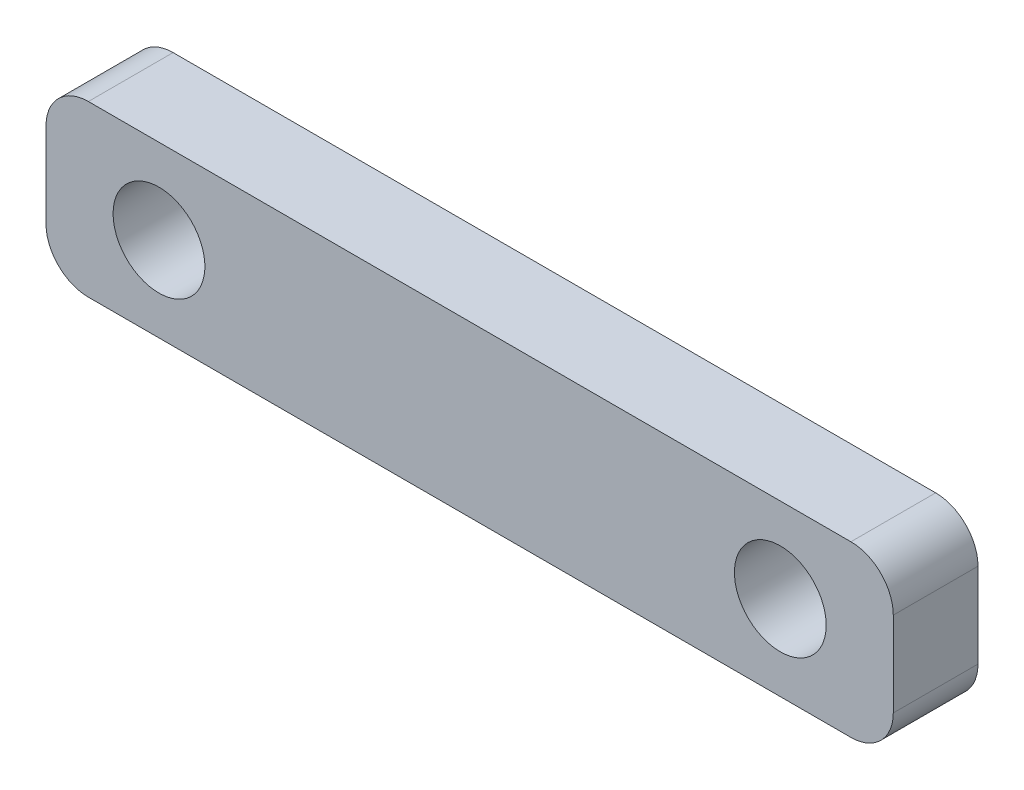
ISO-10303-21;
HEADER;
FILE_DESCRIPTION(('STEP AP214'),'2;1');
FILE_NAME('part.step','',(''),(''),'','','');
FILE_SCHEMA(('AUTOMOTIVE_DESIGN { 1 0 10303 214 1 1 1 1 }'));
ENDSEC;
DATA;
#1=APPLICATION_CONTEXT('core data for automotive mechanical design processes');
#2=APPLICATION_PROTOCOL_DEFINITION('international standard','automotive_design',2000,#1);
#3=PRODUCT_CONTEXT('',#1,'mechanical');
#4=PRODUCT('Part','Part','',(#3));
#5=PRODUCT_RELATED_PRODUCT_CATEGORY('part','',(#4));
#6=PRODUCT_DEFINITION_FORMATION('','',#4);
#7=PRODUCT_DEFINITION_CONTEXT('part definition',#1,'design');
#8=PRODUCT_DEFINITION('design','',#6,#7);
#9=PRODUCT_DEFINITION_SHAPE('','',#8);
#10=(LENGTH_UNIT() NAMED_UNIT(*) SI_UNIT(.MILLI.,.METRE.));
#11=(NAMED_UNIT(*) PLANE_ANGLE_UNIT() SI_UNIT($,.RADIAN.));
#12=(NAMED_UNIT(*) SI_UNIT($,.STERADIAN.) SOLID_ANGLE_UNIT());
#13=UNCERTAINTY_MEASURE_WITH_UNIT(LENGTH_MEASURE(1.E-05),#10,'distance_accuracy_value','');
#14=(GEOMETRIC_REPRESENTATION_CONTEXT(3) GLOBAL_UNCERTAINTY_ASSIGNED_CONTEXT((#13)) GLOBAL_UNIT_ASSIGNED_CONTEXT((#10,
#11,#12)) REPRESENTATION_CONTEXT('',''));
#15=CARTESIAN_POINT('',(0.,0.,0.));
#16=DIRECTION('',(0.,0.,1.));
#17=DIRECTION('',(1.,0.,0.));
#18=AXIS2_PLACEMENT_3D('',#15,#16,#17);
#19=CARTESIAN_POINT('',(-27.,2.99999999999999,6.));
#20=DIRECTION('',(0.,0.,1.));
#21=DIRECTION('',(1.,0.,0.));
#22=AXIS2_PLACEMENT_3D('',#19,#20,#21);
#23=PLANE('',#22);
#24=CARTESIAN_POINT('',(-22.,0.,6.));
#25=DIRECTION('',(0.,0.,-1.));
#26=DIRECTION('',(-1.,0.,0.));
#27=AXIS2_PLACEMENT_3D('',#24,#25,#26);
#28=CIRCLE('',#27,3.25);
#29=CARTESIAN_POINT('',(-25.25,0.,6.));
#30=VERTEX_POINT('',#29);
#31=EDGE_CURVE('E192',#30,#30,#28,.T.);
#32=ORIENTED_EDGE('',*,*,#31,.T.);
#33=EDGE_LOOP('',(#32));
#34=FACE_BOUND('',#33,.T.);
#35=CARTESIAN_POINT('',(-27.,2.99999999999999,6.));
#36=DIRECTION('',(0.,0.,1.));
#37=DIRECTION('',(1.,0.,0.));
#38=AXIS2_PLACEMENT_3D('',#35,#36,#37);
#39=CIRCLE('',#38,3.);
#40=CARTESIAN_POINT('',(-27.,5.99999999999999,6.));
#41=VERTEX_POINT('',#40);
#42=CARTESIAN_POINT('',(-30.,2.99999999999999,6.));
#43=VERTEX_POINT('',#42);
#44=EDGE_CURVE('E95',#41,#43,#39,.T.);
#45=ORIENTED_EDGE('',*,*,#44,.T.);
#46=DIRECTION('',(0.,1.,0.));
#47=VECTOR('',#46,1.);
#48=CARTESIAN_POINT('',(-30.,-2.99999999999999,6.));
#49=LINE('',#48,#47);
#50=CARTESIAN_POINT('',(-30.,-2.99999999999999,6.));
#51=VERTEX_POINT('',#50);
#52=EDGE_CURVE('E177',#51,#43,#49,.T.);
#53=ORIENTED_EDGE('',*,*,#52,.F.);
#54=CARTESIAN_POINT('',(-27.,-2.99999999999999,6.));
#55=DIRECTION('',(0.,0.,1.));
#56=DIRECTION('',(1.,0.,0.));
#57=AXIS2_PLACEMENT_3D('',#54,#55,#56);
#58=CIRCLE('',#57,3.);
#59=CARTESIAN_POINT('',(-27.,-5.99999999999999,6.));
#60=VERTEX_POINT('',#59);
#61=EDGE_CURVE('E166',#51,#60,#58,.T.);
#62=ORIENTED_EDGE('',*,*,#61,.T.);
#63=DIRECTION('',(1.,0.,0.));
#64=VECTOR('',#63,1.);
#65=CARTESIAN_POINT('',(-27.,-5.99999999999999,6.));
#66=LINE('',#65,#64);
#67=CARTESIAN_POINT('',(27.,-5.99999999999999,6.));
#68=VERTEX_POINT('',#67);
#69=EDGE_CURVE('E130',#60,#68,#66,.T.);
#70=ORIENTED_EDGE('',*,*,#69,.T.);
#71=CARTESIAN_POINT('',(27.,-2.99999999999999,6.));
#72=DIRECTION('',(0.,0.,1.));
#73=DIRECTION('',(1.,0.,0.));
#74=AXIS2_PLACEMENT_3D('',#71,#72,#73);
#75=CIRCLE('',#74,3.);
#76=CARTESIAN_POINT('',(30.,-2.99999999999999,6.));
#77=VERTEX_POINT('',#76);
#78=EDGE_CURVE('E127',#68,#77,#75,.T.);
#79=ORIENTED_EDGE('',*,*,#78,.T.);
#80=DIRECTION('',(0.,-1.,0.));
#81=VECTOR('',#80,1.);
#82=CARTESIAN_POINT('',(30.,2.99999999999999,6.));
#83=LINE('',#82,#81);
#84=CARTESIAN_POINT('',(30.,2.99999999999999,6.));
#85=VERTEX_POINT('',#84);
#86=EDGE_CURVE('E116',#85,#77,#83,.T.);
#87=ORIENTED_EDGE('',*,*,#86,.F.);
#88=CARTESIAN_POINT('',(27.,2.99999999999999,6.));
#89=DIRECTION('',(0.,0.,1.));
#90=DIRECTION('',(1.,0.,0.));
#91=AXIS2_PLACEMENT_3D('',#88,#89,#90);
#92=CIRCLE('',#91,3.);
#93=CARTESIAN_POINT('',(27.,5.99999999999999,6.));
#94=VERTEX_POINT('',#93);
#95=EDGE_CURVE('E122',#85,#94,#92,.T.);
#96=ORIENTED_EDGE('',*,*,#95,.T.);
#97=DIRECTION('',(-1.,0.,0.));
#98=VECTOR('',#97,1.);
#99=CARTESIAN_POINT('',(27.,5.99999999999999,6.));
#100=LINE('',#99,#98);
#101=EDGE_CURVE('E56',#94,#41,#100,.T.);
#102=ORIENTED_EDGE('',*,*,#101,.T.);
#103=EDGE_LOOP('',(#45,#53,#62,#70,#79,#87,#96,#102));
#104=FACE_BOUND('',#103,.T.);
#105=CARTESIAN_POINT('',(22.,0.,6.));
#106=DIRECTION('',(0.,0.,1.));
#107=DIRECTION('',(1.,0.,0.));
#108=AXIS2_PLACEMENT_3D('',#105,#106,#107);
#109=CIRCLE('',#108,3.25);
#110=CARTESIAN_POINT('',(25.25,0.,6.));
#111=VERTEX_POINT('',#110);
#112=EDGE_CURVE('E140',#111,#111,#109,.T.);
#113=ORIENTED_EDGE('',*,*,#112,.F.);
#114=EDGE_LOOP('',(#113));
#115=FACE_BOUND('',#114,.T.);
#116=ADVANCED_FACE('F39',(#34,#104,#115),#23,.T.);
#117=CARTESIAN_POINT('',(-27.,2.99999999999999,0.));
#118=DIRECTION('',(0.,0.,1.));
#119=DIRECTION('',(1.,0.,0.));
#120=AXIS2_PLACEMENT_3D('',#117,#118,#119);
#121=PLANE('',#120);
#122=CARTESIAN_POINT('',(-22.,0.,0.));
#123=DIRECTION('',(0.,0.,-1.));
#124=DIRECTION('',(-1.,0.,0.));
#125=AXIS2_PLACEMENT_3D('',#122,#123,#124);
#126=CIRCLE('',#125,3.25);
#127=CARTESIAN_POINT('',(-25.25,0.,0.));
#128=VERTEX_POINT('',#127);
#129=EDGE_CURVE('E195',#128,#128,#126,.T.);
#130=ORIENTED_EDGE('',*,*,#129,.F.);
#131=EDGE_LOOP('',(#130));
#132=FACE_BOUND('',#131,.T.);
#133=CARTESIAN_POINT('',(-27.,2.99999999999999,0.));
#134=DIRECTION('',(0.,0.,1.));
#135=DIRECTION('',(1.,0.,0.));
#136=AXIS2_PLACEMENT_3D('',#133,#134,#135);
#137=CIRCLE('',#136,3.);
#138=CARTESIAN_POINT('',(-27.,5.99999999999999,0.));
#139=VERTEX_POINT('',#138);
#140=CARTESIAN_POINT('',(-30.,2.99999999999999,0.));
#141=VERTEX_POINT('',#140);
#142=EDGE_CURVE('E136',#139,#141,#137,.T.);
#143=ORIENTED_EDGE('',*,*,#142,.F.);
#144=DIRECTION('',(-1.,0.,0.));
#145=VECTOR('',#144,1.);
#146=CARTESIAN_POINT('',(27.,5.99999999999999,0.));
#147=LINE('',#146,#145);
#148=CARTESIAN_POINT('',(27.,5.99999999999999,0.));
#149=VERTEX_POINT('',#148);
#150=EDGE_CURVE('E89',#149,#139,#147,.T.);
#151=ORIENTED_EDGE('',*,*,#150,.F.);
#152=CARTESIAN_POINT('',(27.,2.99999999999999,0.));
#153=DIRECTION('',(0.,0.,1.));
#154=DIRECTION('',(1.,0.,0.));
#155=AXIS2_PLACEMENT_3D('',#152,#153,#154);
#156=CIRCLE('',#155,3.);
#157=CARTESIAN_POINT('',(30.,2.99999999999999,0.));
#158=VERTEX_POINT('',#157);
#159=EDGE_CURVE('E83',#158,#149,#156,.T.);
#160=ORIENTED_EDGE('',*,*,#159,.F.);
#161=DIRECTION('',(0.,-1.,0.));
#162=VECTOR('',#161,1.);
#163=CARTESIAN_POINT('',(30.,2.99999999999999,0.));
#164=LINE('',#163,#162);
#165=CARTESIAN_POINT('',(30.,-2.99999999999999,0.));
#166=VERTEX_POINT('',#165);
#167=EDGE_CURVE('E118',#158,#166,#164,.T.);
#168=ORIENTED_EDGE('',*,*,#167,.T.);
#169=CARTESIAN_POINT('',(27.,-2.99999999999999,0.));
#170=DIRECTION('',(0.,0.,1.));
#171=DIRECTION('',(1.,0.,0.));
#172=AXIS2_PLACEMENT_3D('',#169,#170,#171);
#173=CIRCLE('',#172,3.);
#174=CARTESIAN_POINT('',(27.,-5.99999999999999,0.));
#175=VERTEX_POINT('',#174);
#176=EDGE_CURVE('E147',#175,#166,#173,.T.);
#177=ORIENTED_EDGE('',*,*,#176,.F.);
#178=DIRECTION('',(1.,0.,0.));
#179=VECTOR('',#178,1.);
#180=CARTESIAN_POINT('',(-27.,-5.99999999999999,0.));
#181=LINE('',#180,#179);
#182=CARTESIAN_POINT('',(-27.,-5.99999999999999,0.));
#183=VERTEX_POINT('',#182);
#184=EDGE_CURVE('E145',#183,#175,#181,.T.);
#185=ORIENTED_EDGE('',*,*,#184,.F.);
#186=CARTESIAN_POINT('',(-27.,-2.99999999999999,0.));
#187=DIRECTION('',(0.,0.,1.));
#188=DIRECTION('',(1.,0.,0.));
#189=AXIS2_PLACEMENT_3D('',#186,#187,#188);
#190=CIRCLE('',#189,3.);
#191=CARTESIAN_POINT('',(-30.,-2.99999999999999,0.));
#192=VERTEX_POINT('',#191);
#193=EDGE_CURVE('E143',#192,#183,#190,.T.);
#194=ORIENTED_EDGE('',*,*,#193,.F.);
#195=DIRECTION('',(0.,1.,0.));
#196=VECTOR('',#195,1.);
#197=CARTESIAN_POINT('',(-30.,-2.99999999999999,0.));
#198=LINE('',#197,#196);
#199=EDGE_CURVE('E139',#192,#141,#198,.T.);
#200=ORIENTED_EDGE('',*,*,#199,.T.);
#201=EDGE_LOOP('',(#143,#151,#160,#168,#177,#185,#194,#200));
#202=FACE_BOUND('',#201,.T.);
#203=CARTESIAN_POINT('',(22.,0.,0.));
#204=DIRECTION('',(0.,0.,1.));
#205=DIRECTION('',(1.,0.,0.));
#206=AXIS2_PLACEMENT_3D('',#203,#204,#205);
#207=CIRCLE('',#206,3.25);
#208=CARTESIAN_POINT('',(25.25,0.,0.));
#209=VERTEX_POINT('',#208);
#210=EDGE_CURVE('E189',#209,#209,#207,.T.);
#211=ORIENTED_EDGE('',*,*,#210,.T.);
#212=EDGE_LOOP('',(#211));
#213=FACE_BOUND('',#212,.T.);
#214=ADVANCED_FACE('F173',(#132,#202,#213),#121,.F.);
#215=CARTESIAN_POINT('',(-27.,2.99999999999999,6.));
#216=DIRECTION('',(0.,0.,-1.));
#217=DIRECTION('',(-1.,0.,0.));
#218=AXIS2_PLACEMENT_3D('',#215,#216,#217);
#219=CYLINDRICAL_SURFACE('',#218,3.);
#220=ORIENTED_EDGE('',*,*,#142,.T.);
#221=DIRECTION('',(0.,0.,-1.));
#222=VECTOR('',#221,1.);
#223=CARTESIAN_POINT('',(-30.,2.99999999999999,6.));
#224=LINE('',#223,#222);
#225=EDGE_CURVE('E11',#43,#141,#224,.T.);
#226=ORIENTED_EDGE('',*,*,#225,.F.);
#227=ORIENTED_EDGE('',*,*,#44,.F.);
#228=DIRECTION('',(0.,0.,-1.));
#229=VECTOR('',#228,1.);
#230=CARTESIAN_POINT('',(-27.,5.99999999999999,6.));
#231=LINE('',#230,#229);
#232=EDGE_CURVE('E135',#41,#139,#231,.T.);
#233=ORIENTED_EDGE('',*,*,#232,.T.);
#234=EDGE_LOOP('',(#220,#226,#227,#233));
#235=FACE_BOUND('',#234,.T.);
#236=ADVANCED_FACE('F41',(#235),#219,.T.);
#237=CARTESIAN_POINT('',(-30.,-2.99999999999999,6.));
#238=DIRECTION('',(-1.,0.,0.));
#239=DIRECTION('',(0.,0.,1.));
#240=AXIS2_PLACEMENT_3D('',#237,#238,#239);
#241=PLANE('',#240);
#242=ORIENTED_EDGE('',*,*,#199,.F.);
#243=DIRECTION('',(0.,0.,-1.));
#244=VECTOR('',#243,1.);
#245=CARTESIAN_POINT('',(-30.,-2.99999999999999,6.));
#246=LINE('',#245,#244);
#247=EDGE_CURVE('E48',#51,#192,#246,.T.);
#248=ORIENTED_EDGE('',*,*,#247,.F.);
#249=ORIENTED_EDGE('',*,*,#52,.T.);
#250=ORIENTED_EDGE('',*,*,#225,.T.);
#251=EDGE_LOOP('',(#242,#248,#249,#250));
#252=FACE_BOUND('',#251,.T.);
#253=ADVANCED_FACE('F176',(#252),#241,.T.);
#254=CARTESIAN_POINT('',(-27.,-2.99999999999999,6.));
#255=DIRECTION('',(0.,0.,-1.));
#256=DIRECTION('',(-1.,0.,0.));
#257=AXIS2_PLACEMENT_3D('',#254,#255,#256);
#258=CYLINDRICAL_SURFACE('',#257,3.);
#259=ORIENTED_EDGE('',*,*,#193,.T.);
#260=DIRECTION('',(0.,0.,-1.));
#261=VECTOR('',#260,1.);
#262=CARTESIAN_POINT('',(-27.,-5.99999999999999,6.));
#263=LINE('',#262,#261);
#264=EDGE_CURVE('E159',#60,#183,#263,.T.);
#265=ORIENTED_EDGE('',*,*,#264,.F.);
#266=ORIENTED_EDGE('',*,*,#61,.F.);
#267=ORIENTED_EDGE('',*,*,#247,.T.);
#268=EDGE_LOOP('',(#259,#265,#266,#267));
#269=FACE_BOUND('',#268,.T.);
#270=ADVANCED_FACE('F164',(#269),#258,.T.);
#271=CARTESIAN_POINT('',(-27.,-5.99999999999999,6.));
#272=DIRECTION('',(0.,1.,0.));
#273=DIRECTION('',(0.,0.,1.));
#274=AXIS2_PLACEMENT_3D('',#271,#272,#273);
#275=PLANE('',#274);
#276=ORIENTED_EDGE('',*,*,#184,.T.);
#277=DIRECTION('',(0.,0.,-1.));
#278=VECTOR('',#277,1.);
#279=CARTESIAN_POINT('',(27.,-5.99999999999999,6.));
#280=LINE('',#279,#278);
#281=EDGE_CURVE('E156',#68,#175,#280,.T.);
#282=ORIENTED_EDGE('',*,*,#281,.F.);
#283=ORIENTED_EDGE('',*,*,#69,.F.);
#284=ORIENTED_EDGE('',*,*,#264,.T.);
#285=EDGE_LOOP('',(#276,#282,#283,#284));
#286=FACE_BOUND('',#285,.T.);
#287=ADVANCED_FACE('F184',(#286),#275,.F.);
#288=CARTESIAN_POINT('',(27.,-2.99999999999999,6.));
#289=DIRECTION('',(0.,0.,-1.));
#290=DIRECTION('',(-1.,0.,0.));
#291=AXIS2_PLACEMENT_3D('',#288,#289,#290);
#292=CYLINDRICAL_SURFACE('',#291,3.);
#293=ORIENTED_EDGE('',*,*,#176,.T.);
#294=DIRECTION('',(0.,0.,-1.));
#295=VECTOR('',#294,1.);
#296=CARTESIAN_POINT('',(30.,-2.99999999999999,6.));
#297=LINE('',#296,#295);
#298=EDGE_CURVE('E119',#77,#166,#297,.T.);
#299=ORIENTED_EDGE('',*,*,#298,.F.);
#300=ORIENTED_EDGE('',*,*,#78,.F.);
#301=ORIENTED_EDGE('',*,*,#281,.T.);
#302=EDGE_LOOP('',(#293,#299,#300,#301));
#303=FACE_BOUND('',#302,.T.);
#304=ADVANCED_FACE('F180',(#303),#292,.T.);
#305=CARTESIAN_POINT('',(30.,2.99999999999999,6.));
#306=DIRECTION('',(1.,0.,0.));
#307=DIRECTION('',(0.,0.,-1.));
#308=AXIS2_PLACEMENT_3D('',#305,#306,#307);
#309=PLANE('',#308);
#310=ORIENTED_EDGE('',*,*,#167,.F.);
#311=DIRECTION('',(0.,0.,-1.));
#312=VECTOR('',#311,1.);
#313=CARTESIAN_POINT('',(30.,2.99999999999999,6.));
#314=LINE('',#313,#312);
#315=EDGE_CURVE('E112',#85,#158,#314,.T.);
#316=ORIENTED_EDGE('',*,*,#315,.F.);
#317=ORIENTED_EDGE('',*,*,#86,.T.);
#318=ORIENTED_EDGE('',*,*,#298,.T.);
#319=EDGE_LOOP('',(#310,#316,#317,#318));
#320=FACE_BOUND('',#319,.T.);
#321=ADVANCED_FACE('F114',(#320),#309,.T.);
#322=CARTESIAN_POINT('',(27.,2.99999999999999,6.));
#323=DIRECTION('',(0.,0.,-1.));
#324=DIRECTION('',(-1.,0.,0.));
#325=AXIS2_PLACEMENT_3D('',#322,#323,#324);
#326=CYLINDRICAL_SURFACE('',#325,3.);
#327=ORIENTED_EDGE('',*,*,#159,.T.);
#328=DIRECTION('',(0.,0.,-1.));
#329=VECTOR('',#328,1.);
#330=CARTESIAN_POINT('',(27.,5.99999999999999,6.));
#331=LINE('',#330,#329);
#332=EDGE_CURVE('E120',#94,#149,#331,.T.);
#333=ORIENTED_EDGE('',*,*,#332,.F.);
#334=ORIENTED_EDGE('',*,*,#95,.F.);
#335=ORIENTED_EDGE('',*,*,#315,.T.);
#336=EDGE_LOOP('',(#327,#333,#334,#335));
#337=FACE_BOUND('',#336,.T.);
#338=ADVANCED_FACE('F123',(#337),#326,.T.);
#339=CARTESIAN_POINT('',(27.,5.99999999999999,6.));
#340=DIRECTION('',(0.,-1.,0.));
#341=DIRECTION('',(0.,0.,-1.));
#342=AXIS2_PLACEMENT_3D('',#339,#340,#341);
#343=PLANE('',#342);
#344=ORIENTED_EDGE('',*,*,#150,.T.);
#345=ORIENTED_EDGE('',*,*,#232,.F.);
#346=ORIENTED_EDGE('',*,*,#101,.F.);
#347=ORIENTED_EDGE('',*,*,#332,.T.);
#348=EDGE_LOOP('',(#344,#345,#346,#347));
#349=FACE_BOUND('',#348,.T.);
#350=ADVANCED_FACE('F218',(#349),#343,.F.);
#351=CARTESIAN_POINT('',(22.,0.,6.));
#352=DIRECTION('',(0.,0.,-1.));
#353=DIRECTION('',(-1.,0.,0.));
#354=AXIS2_PLACEMENT_3D('',#351,#352,#353);
#355=CYLINDRICAL_SURFACE('',#354,3.25);
#356=ORIENTED_EDGE('',*,*,#112,.T.);
#357=EDGE_LOOP('',(#356));
#358=FACE_BOUND('',#357,.T.);
#359=ORIENTED_EDGE('',*,*,#210,.F.);
#360=EDGE_LOOP('',(#359));
#361=FACE_BOUND('',#360,.T.);
#362=ADVANCED_FACE('F205',(#358,#361),#355,.F.);
#363=CARTESIAN_POINT('',(-22.,0.,6.));
#364=DIRECTION('',(0.,0.,-1.));
#365=DIRECTION('',(-1.,0.,0.));
#366=AXIS2_PLACEMENT_3D('',#363,#364,#365);
#367=CYLINDRICAL_SURFACE('',#366,3.25);
#368=ORIENTED_EDGE('',*,*,#31,.F.);
#369=EDGE_LOOP('',(#368));
#370=FACE_BOUND('',#369,.T.);
#371=ORIENTED_EDGE('',*,*,#129,.T.);
#372=EDGE_LOOP('',(#371));
#373=FACE_BOUND('',#372,.T.);
#374=ADVANCED_FACE('F202',(#370,#373),#367,.F.);
#375=CLOSED_SHELL('',(#116,#214,#236,#253,#270,#287,#304,#321,#338,#350,#362,#374));
#376=MANIFOLD_SOLID_BREP('B2',#375);
#377=ADVANCED_BREP_SHAPE_REPRESENTATION('',(#18,#376),#14);
#378=SHAPE_DEFINITION_REPRESENTATION(#9,#377);
ENDSEC;
END-ISO-10303-21;
